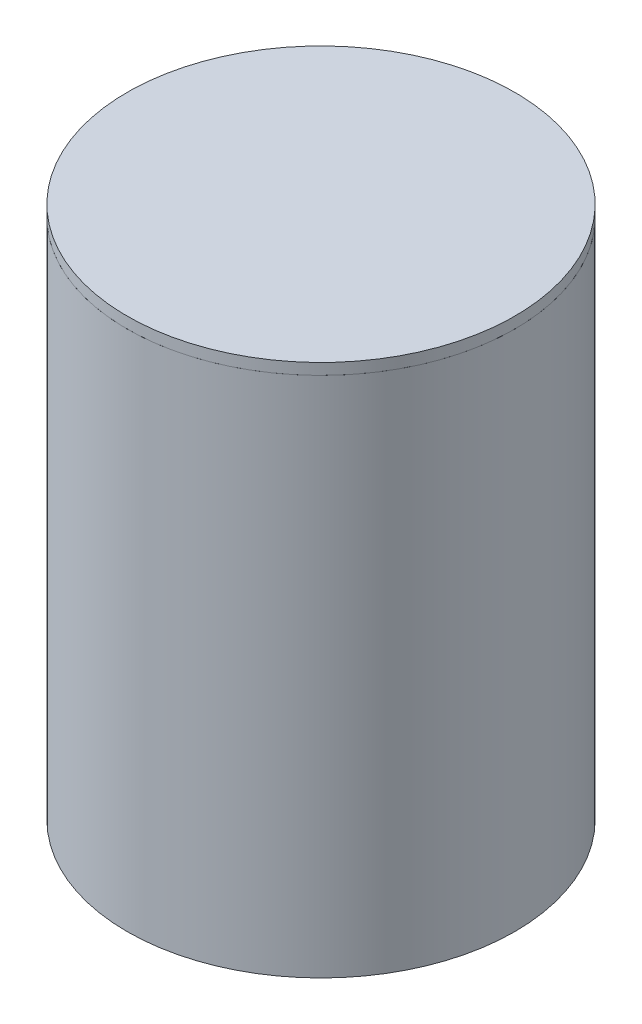
ISO-10303-21;
HEADER;
FILE_DESCRIPTION(('STEP AP214'),'2;1');
FILE_NAME('part.step','',(''),(''),'','','');
FILE_SCHEMA(('AUTOMOTIVE_DESIGN { 1 0 10303 214 1 1 1 1 }'));
ENDSEC;
DATA;
#1=APPLICATION_CONTEXT('core data for automotive mechanical design processes');
#2=APPLICATION_PROTOCOL_DEFINITION('international standard','automotive_design',2000,#1);
#3=PRODUCT_CONTEXT('',#1,'mechanical');
#4=PRODUCT('Part','Part','',(#3));
#5=PRODUCT_RELATED_PRODUCT_CATEGORY('part','',(#4));
#6=PRODUCT_DEFINITION_FORMATION('','',#4);
#7=PRODUCT_DEFINITION_CONTEXT('part definition',#1,'design');
#8=PRODUCT_DEFINITION('design','',#6,#7);
#9=PRODUCT_DEFINITION_SHAPE('','',#8);
#10=(LENGTH_UNIT() NAMED_UNIT(*) SI_UNIT(.MILLI.,.METRE.));
#11=(NAMED_UNIT(*) PLANE_ANGLE_UNIT() SI_UNIT($,.RADIAN.));
#12=(NAMED_UNIT(*) SI_UNIT($,.STERADIAN.) SOLID_ANGLE_UNIT());
#13=UNCERTAINTY_MEASURE_WITH_UNIT(LENGTH_MEASURE(1.E-05),#10,'distance_accuracy_value','');
#14=(GEOMETRIC_REPRESENTATION_CONTEXT(3) GLOBAL_UNCERTAINTY_ASSIGNED_CONTEXT((#13)) GLOBAL_UNIT_ASSIGNED_CONTEXT((#10,
#11,#12)) REPRESENTATION_CONTEXT('',''));
#15=CARTESIAN_POINT('',(0.,0.,0.));
#16=DIRECTION('',(0.,0.,1.));
#17=DIRECTION('',(1.,0.,0.));
#18=AXIS2_PLACEMENT_3D('',#15,#16,#17);
#19=CARTESIAN_POINT('',(38.0883505428011,134.604042857155,120.6838600894));
#20=DIRECTION('',(0.,1.,0.));
#21=DIRECTION('',(0.430442520786681,0.,0.902617990236627));
#22=AXIS2_PLACEMENT_3D('',#19,#20,#21);
#23=CYLINDRICAL_SURFACE('',#22,52.);
#24=CARTESIAN_POINT('',(38.0883505428011,134.604042857155,120.6838600894));
#25=DIRECTION('',(0.,-1.,0.));
#26=DIRECTION('',(-0.430442520786681,0.,-0.902617990236627));
#27=AXIS2_PLACEMENT_3D('',#24,#25,#26);
#28=CIRCLE('',#27,52.);
#29=CARTESIAN_POINT('',(15.7053394618937,134.604042857155,73.7477245970952));
#30=VERTEX_POINT('',#29);
#31=EDGE_CURVE('P0_E21',#30,#30,#28,.T.);
#32=ORIENTED_EDGE('',*,*,#31,.F.);
#33=EDGE_LOOP('',(#32));
#34=FACE_BOUND('',#33,.T.);
#35=CARTESIAN_POINT('',(38.0883505428011,137.604042857155,120.6838600894));
#36=DIRECTION('',(0.,-1.,0.));
#37=DIRECTION('',(-0.430442520786681,0.,-0.902617990236627));
#38=AXIS2_PLACEMENT_3D('',#35,#36,#37);
#39=CIRCLE('',#38,52.);
#40=CARTESIAN_POINT('',(15.7053394618937,137.604042857155,73.7477245970952));
#41=VERTEX_POINT('',#40);
#42=EDGE_CURVE('P0_E17',#41,#41,#39,.T.);
#43=ORIENTED_EDGE('',*,*,#42,.T.);
#44=EDGE_LOOP('',(#43));
#45=FACE_BOUND('',#44,.T.);
#46=ADVANCED_FACE('P0_F14',(#34,#45),#23,.T.);
#47=CARTESIAN_POINT('',(38.0883505428011,134.604042857155,120.6838600894));
#48=DIRECTION('',(0.,-1.,0.));
#49=DIRECTION('',(-0.430442520786681,0.,-0.902617990236627));
#50=AXIS2_PLACEMENT_3D('',#47,#48,#49);
#51=PLANE('',#50);
#52=CARTESIAN_POINT('',(38.0883505428011,134.604042857155,120.6838600894));
#53=DIRECTION('',(0.,-1.,0.));
#54=DIRECTION('',(-0.430442520786681,0.,-0.902617990236627));
#55=AXIS2_PLACEMENT_3D('',#52,#53,#54);
#56=CIRCLE('',#55,43.8);
#57=CARTESIAN_POINT('',(19.2349681323445,134.604042857155,81.1491921170355));
#58=VERTEX_POINT('',#57);
#59=EDGE_CURVE('P0_E9',#58,#58,#56,.T.);
#60=ORIENTED_EDGE('',*,*,#59,.F.);
#61=EDGE_LOOP('',(#60));
#62=FACE_BOUND('',#61,.T.);
#63=ORIENTED_EDGE('',*,*,#31,.T.);
#64=EDGE_LOOP('',(#63));
#65=FACE_BOUND('',#64,.T.);
#66=ADVANCED_FACE('P0_F38',(#62,#65),#51,.T.);
#67=CARTESIAN_POINT('',(38.0883505428011,137.604042857155,120.6838600894));
#68=DIRECTION('',(0.,-1.,0.));
#69=DIRECTION('',(-0.430442520786681,0.,-0.902617990236627));
#70=AXIS2_PLACEMENT_3D('',#67,#68,#69);
#71=PLANE('',#70);
#72=ORIENTED_EDGE('',*,*,#42,.F.);
#73=EDGE_LOOP('',(#72));
#74=FACE_BOUND('',#73,.T.);
#75=ADVANCED_FACE('P0_F35',(#74),#71,.F.);
#76=CARTESIAN_POINT('',(38.0883505428011,129.604042857155,120.6838600894));
#77=DIRECTION('',(0.,1.,0.));
#78=DIRECTION('',(0.430442520786681,0.,0.902617990236627));
#79=AXIS2_PLACEMENT_3D('',#76,#77,#78);
#80=CYLINDRICAL_SURFACE('',#79,43.8);
#81=CARTESIAN_POINT('',(38.0883505428011,129.604042857155,120.6838600894));
#82=DIRECTION('',(0.,-1.,0.));
#83=DIRECTION('',(-0.430442520786681,0.,-0.902617990236627));
#84=AXIS2_PLACEMENT_3D('',#81,#82,#83);
#85=CIRCLE('',#84,43.8);
#86=CARTESIAN_POINT('',(19.2349681323445,129.604042857155,81.1491921170355));
#87=VERTEX_POINT('',#86);
#88=EDGE_CURVE('P0_E27',#87,#87,#85,.T.);
#89=ORIENTED_EDGE('',*,*,#88,.F.);
#90=EDGE_LOOP('',(#89));
#91=FACE_BOUND('',#90,.T.);
#92=ORIENTED_EDGE('',*,*,#59,.T.);
#93=EDGE_LOOP('',(#92));
#94=FACE_BOUND('',#93,.T.);
#95=ADVANCED_FACE('P0_F37',(#91,#94),#80,.T.);
#96=CARTESIAN_POINT('',(38.0883505428011,129.604042857155,120.6838600894));
#97=DIRECTION('',(0.,-1.,0.));
#98=DIRECTION('',(-0.430442520786681,0.,-0.902617990236627));
#99=AXIS2_PLACEMENT_3D('',#96,#97,#98);
#100=PLANE('',#99);
#101=ORIENTED_EDGE('',*,*,#88,.T.);
#102=EDGE_LOOP('',(#101));
#103=FACE_BOUND('',#102,.T.);
#104=ADVANCED_FACE('P0_F44',(#103),#100,.T.);
#105=CLOSED_SHELL('',(#46,#66,#75,#95,#104));
#106=MANIFOLD_SOLID_BREP('P0_B1',#105);
#107=CARTESIAN_POINT('',(38.0883505428011,134.604042857155,120.6838600894));
#108=DIRECTION('',(0.,-1.,0.));
#109=DIRECTION('',(0.,0.,-1.));
#110=AXIS2_PLACEMENT_3D('',#107,#108,#109);
#111=CYLINDRICAL_SURFACE('',#110,44.);
#112=CARTESIAN_POINT('',(38.0883505428011,134.604042857155,120.6838600894));
#113=DIRECTION('',(0.,1.,0.));
#114=DIRECTION('',(0.,0.,1.));
#115=AXIS2_PLACEMENT_3D('',#112,#113,#114);
#116=CIRCLE('',#115,44.);
#117=CARTESIAN_POINT('',(38.0883505428011,134.604042857155,164.6838600894));
#118=VERTEX_POINT('',#117);
#119=EDGE_CURVE('P1_E31',#118,#118,#116,.T.);
#120=ORIENTED_EDGE('',*,*,#119,.T.);
#121=EDGE_LOOP('',(#120));
#122=FACE_BOUND('',#121,.T.);
#123=CARTESIAN_POINT('',(38.0883505428011,2.60404285715533,120.6838600894));
#124=DIRECTION('',(0.,1.,0.));
#125=DIRECTION('',(0.,0.,1.));
#126=AXIS2_PLACEMENT_3D('',#123,#124,#125);
#127=CIRCLE('',#126,44.);
#128=CARTESIAN_POINT('',(38.0883505428011,2.60404285715533,164.6838600894));
#129=VERTEX_POINT('',#128);
#130=EDGE_CURVE('P1_E10',#129,#129,#127,.T.);
#131=ORIENTED_EDGE('',*,*,#130,.F.);
#132=EDGE_LOOP('',(#131));
#133=FACE_BOUND('',#132,.T.);
#134=ADVANCED_FACE('P1_F15',(#122,#133),#111,.F.);
#135=CARTESIAN_POINT('',(38.0883505428011,2.60404285715533,120.6838600894));
#136=DIRECTION('',(0.,1.,0.));
#137=DIRECTION('',(0.,0.,1.));
#138=AXIS2_PLACEMENT_3D('',#135,#136,#137);
#139=PLANE('',#138);
#140=ORIENTED_EDGE('',*,*,#130,.T.);
#141=EDGE_LOOP('',(#140));
#142=FACE_BOUND('',#141,.T.);
#143=ADVANCED_FACE('P1_F17',(#142),#139,.T.);
#144=CARTESIAN_POINT('',(38.0883505428011,134.604042857155,120.6838600894));
#145=DIRECTION('',(0.,-1.,0.));
#146=DIRECTION('',(0.,0.,-1.));
#147=AXIS2_PLACEMENT_3D('',#144,#145,#146);
#148=CYLINDRICAL_SURFACE('',#147,52.);
#149=CARTESIAN_POINT('',(38.0883505428011,134.604042857155,120.6838600894));
#150=DIRECTION('',(0.,1.,0.));
#151=DIRECTION('',(0.,0.,1.));
#152=AXIS2_PLACEMENT_3D('',#149,#150,#151);
#153=CIRCLE('',#152,52.);
#154=CARTESIAN_POINT('',(38.0883505428011,134.604042857155,172.6838600894));
#155=VERTEX_POINT('',#154);
#156=EDGE_CURVE('P1_E22',#155,#155,#153,.T.);
#157=ORIENTED_EDGE('',*,*,#156,.F.);
#158=EDGE_LOOP('',(#157));
#159=FACE_BOUND('',#158,.T.);
#160=CARTESIAN_POINT('',(38.0883505428011,-5.39595714284467,120.6838600894));
#161=DIRECTION('',(0.,1.,0.));
#162=DIRECTION('',(0.,0.,1.));
#163=AXIS2_PLACEMENT_3D('',#160,#161,#162);
#164=CIRCLE('',#163,52.);
#165=CARTESIAN_POINT('',(38.0883505428011,-5.39595714284467,172.6838600894));
#166=VERTEX_POINT('',#165);
#167=EDGE_CURVE('P1_E26',#166,#166,#164,.T.);
#168=ORIENTED_EDGE('',*,*,#167,.T.);
#169=EDGE_LOOP('',(#168));
#170=FACE_BOUND('',#169,.T.);
#171=ADVANCED_FACE('P1_F41',(#159,#170),#148,.T.);
#172=CARTESIAN_POINT('',(38.0883505428011,134.604042857155,120.6838600894));
#173=DIRECTION('',(0.,1.,0.));
#174=DIRECTION('',(0.,0.,1.));
#175=AXIS2_PLACEMENT_3D('',#172,#173,#174);
#176=PLANE('',#175);
#177=ORIENTED_EDGE('',*,*,#119,.F.);
#178=EDGE_LOOP('',(#177));
#179=FACE_BOUND('',#178,.T.);
#180=ORIENTED_EDGE('',*,*,#156,.T.);
#181=EDGE_LOOP('',(#180));
#182=FACE_BOUND('',#181,.T.);
#183=ADVANCED_FACE('P1_F38',(#179,#182),#176,.T.);
#184=CARTESIAN_POINT('',(38.0883505428011,-5.39595714284467,120.6838600894));
#185=DIRECTION('',(0.,1.,0.));
#186=DIRECTION('',(0.,0.,1.));
#187=AXIS2_PLACEMENT_3D('',#184,#185,#186);
#188=PLANE('',#187);
#189=ORIENTED_EDGE('',*,*,#167,.F.);
#190=EDGE_LOOP('',(#189));
#191=FACE_BOUND('',#190,.T.);
#192=ADVANCED_FACE('P1_F40',(#191),#188,.F.);
#193=CLOSED_SHELL('',(#134,#143,#171,#183,#192));
#194=MANIFOLD_SOLID_BREP('P1_B1',#193);
#195=ADVANCED_BREP_SHAPE_REPRESENTATION('',(#18,#106,#194),#14);
#196=SHAPE_DEFINITION_REPRESENTATION(#9,#195);
ENDSEC;
END-ISO-10303-21;
